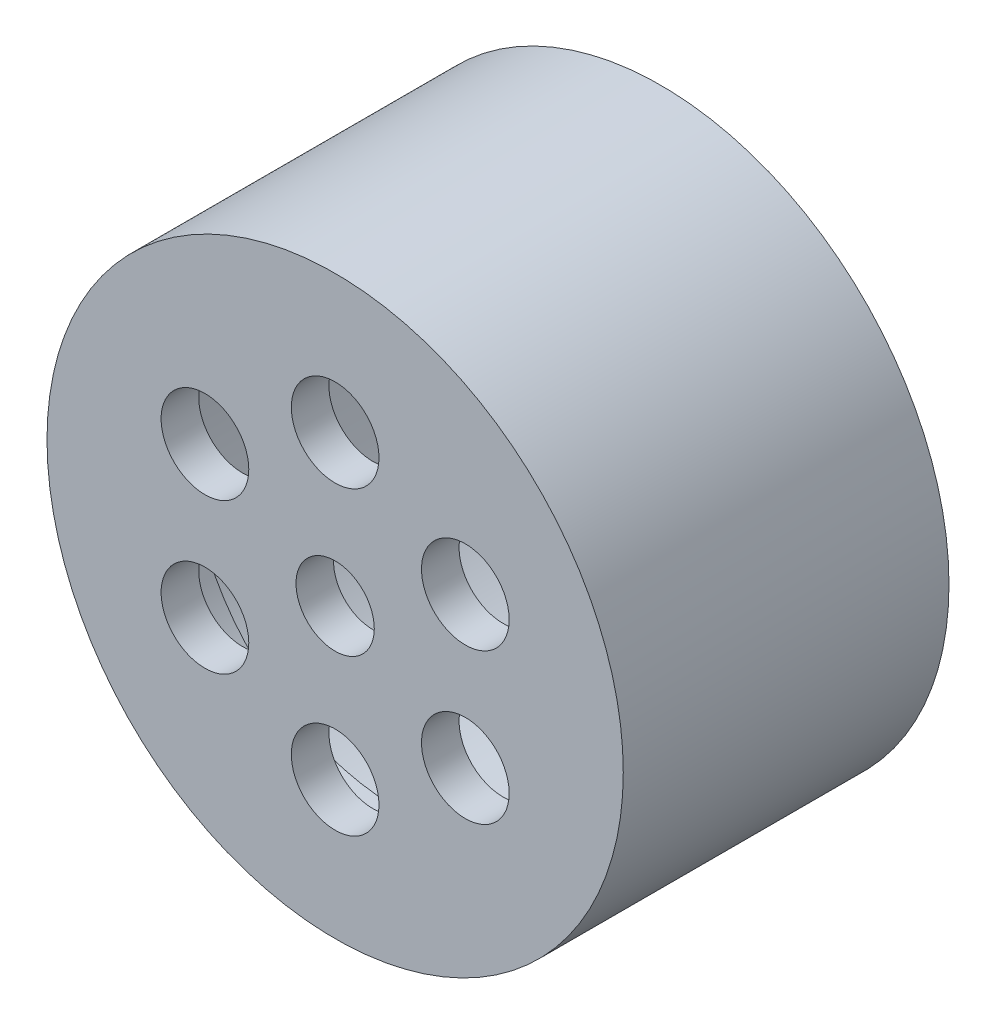
ISO-10303-21;
HEADER;
FILE_DESCRIPTION(('STEP AP214'),'2;1');
FILE_NAME('part.step','',(''),(''),'','','');
FILE_SCHEMA(('AUTOMOTIVE_DESIGN { 1 0 10303 214 1 1 1 1 }'));
ENDSEC;
DATA;
#1=APPLICATION_CONTEXT('core data for automotive mechanical design processes');
#2=APPLICATION_PROTOCOL_DEFINITION('international standard','automotive_design',2000,#1);
#3=PRODUCT_CONTEXT('',#1,'mechanical');
#4=PRODUCT('Part','Part','',(#3));
#5=PRODUCT_RELATED_PRODUCT_CATEGORY('part','',(#4));
#6=PRODUCT_DEFINITION_FORMATION('','',#4);
#7=PRODUCT_DEFINITION_CONTEXT('part definition',#1,'design');
#8=PRODUCT_DEFINITION('design','',#6,#7);
#9=PRODUCT_DEFINITION_SHAPE('','',#8);
#10=(LENGTH_UNIT() NAMED_UNIT(*) SI_UNIT(.MILLI.,.METRE.));
#11=(NAMED_UNIT(*) PLANE_ANGLE_UNIT() SI_UNIT($,.RADIAN.));
#12=(NAMED_UNIT(*) SI_UNIT($,.STERADIAN.) SOLID_ANGLE_UNIT());
#13=UNCERTAINTY_MEASURE_WITH_UNIT(LENGTH_MEASURE(1.E-05),#10,'distance_accuracy_value','');
#14=(GEOMETRIC_REPRESENTATION_CONTEXT(3) GLOBAL_UNCERTAINTY_ASSIGNED_CONTEXT((#13)) GLOBAL_UNIT_ASSIGNED_CONTEXT((#10,
#11,#12)) REPRESENTATION_CONTEXT('',''));
#15=CARTESIAN_POINT('',(0.,0.,0.));
#16=DIRECTION('',(0.,0.,1.));
#17=DIRECTION('',(1.,0.,0.));
#18=AXIS2_PLACEMENT_3D('',#15,#16,#17);
#19=CARTESIAN_POINT('',(0.,0.,23.));
#20=DIRECTION('',(0.,0.,1.));
#21=DIRECTION('',(1.,0.,0.));
#22=AXIS2_PLACEMENT_3D('',#19,#20,#21);
#23=PLANE('',#22);
#24=CARTESIAN_POINT('',(0.,0.,23.));
#25=DIRECTION('',(0.,0.,1.));
#26=DIRECTION('',(1.,0.,0.));
#27=AXIS2_PLACEMENT_3D('',#24,#25,#26);
#28=CIRCLE('',#27,3.125);
#29=CARTESIAN_POINT('',(3.125,0.,23.));
#30=VERTEX_POINT('',#29);
#31=EDGE_CURVE('E62',#30,#30,#28,.T.);
#32=ORIENTED_EDGE('',*,*,#31,.T.);
#33=EDGE_LOOP('',(#32));
#34=FACE_BOUND('',#33,.T.);
#35=CARTESIAN_POINT('',(0.,12.,23.));
#36=DIRECTION('',(0.,0.,1.));
#37=DIRECTION('',(1.,0.,0.));
#38=AXIS2_PLACEMENT_3D('',#35,#36,#37);
#39=CIRCLE('',#38,3.5);
#40=CARTESIAN_POINT('',(3.5,12.,23.));
#41=VERTEX_POINT('',#40);
#42=EDGE_CURVE('E70',#41,#41,#39,.T.);
#43=ORIENTED_EDGE('',*,*,#42,.T.);
#44=EDGE_LOOP('',(#43));
#45=FACE_BOUND('',#44,.T.);
#46=CARTESIAN_POINT('',(10.3923048454136,6.00000000000063,23.));
#47=DIRECTION('',(0.,0.,1.));
#48=DIRECTION('',(1.,0.,0.));
#49=AXIS2_PLACEMENT_3D('',#46,#47,#48);
#50=CIRCLE('',#49,3.5);
#51=CARTESIAN_POINT('',(13.8923048454136,6.00000000000063,23.));
#52=VERTEX_POINT('',#51);
#53=EDGE_CURVE('E78',#52,#52,#50,.T.);
#54=ORIENTED_EDGE('',*,*,#53,.T.);
#55=EDGE_LOOP('',(#54));
#56=FACE_BOUND('',#55,.T.);
#57=CARTESIAN_POINT('',(10.3923048454143,-5.99999999999937,23.));
#58=DIRECTION('',(0.,0.,1.));
#59=DIRECTION('',(1.,0.,0.));
#60=AXIS2_PLACEMENT_3D('',#57,#58,#59);
#61=CIRCLE('',#60,3.5);
#62=CARTESIAN_POINT('',(13.8923048454143,-5.99999999999937,23.));
#63=VERTEX_POINT('',#62);
#64=EDGE_CURVE('E86',#63,#63,#61,.T.);
#65=ORIENTED_EDGE('',*,*,#64,.T.);
#66=EDGE_LOOP('',(#65));
#67=FACE_BOUND('',#66,.T.);
#68=CARTESIAN_POINT('',(1.44264915887538E-12,-12.,23.));
#69=DIRECTION('',(0.,0.,1.));
#70=DIRECTION('',(1.,0.,0.));
#71=AXIS2_PLACEMENT_3D('',#68,#69,#70);
#72=CIRCLE('',#71,3.5);
#73=CARTESIAN_POINT('',(3.50000000000144,-12.,23.));
#74=VERTEX_POINT('',#73);
#75=EDGE_CURVE('E94',#74,#74,#72,.T.);
#76=ORIENTED_EDGE('',*,*,#75,.T.);
#77=EDGE_LOOP('',(#76));
#78=FACE_BOUND('',#77,.T.);
#79=CARTESIAN_POINT('',(-10.3923048454122,-6.00000000000063,23.));
#80=DIRECTION('',(0.,0.,1.));
#81=DIRECTION('',(1.,0.,0.));
#82=AXIS2_PLACEMENT_3D('',#79,#80,#81);
#83=CIRCLE('',#82,3.5);
#84=CARTESIAN_POINT('',(-6.89230484541218,-6.00000000000063,23.));
#85=VERTEX_POINT('',#84);
#86=EDGE_CURVE('E102',#85,#85,#83,.T.);
#87=ORIENTED_EDGE('',*,*,#86,.T.);
#88=EDGE_LOOP('',(#87));
#89=FACE_BOUND('',#88,.T.);
#90=CARTESIAN_POINT('',(-10.3923048454129,5.99999999999937,23.));
#91=DIRECTION('',(0.,0.,1.));
#92=DIRECTION('',(1.,0.,0.));
#93=AXIS2_PLACEMENT_3D('',#90,#91,#92);
#94=CIRCLE('',#93,3.5);
#95=CARTESIAN_POINT('',(-6.89230484541291,5.99999999999937,23.));
#96=VERTEX_POINT('',#95);
#97=EDGE_CURVE('E110',#96,#96,#94,.T.);
#98=ORIENTED_EDGE('',*,*,#97,.T.);
#99=EDGE_LOOP('',(#98));
#100=FACE_BOUND('',#99,.T.);
#101=CARTESIAN_POINT('',(0.,0.,23.));
#102=DIRECTION('',(0.,0.,-1.));
#103=DIRECTION('',(-1.,0.,0.));
#104=AXIS2_PLACEMENT_3D('',#101,#102,#103);
#105=CIRCLE('',#104,16.5);
#106=CARTESIAN_POINT('',(-16.5,0.,23.));
#107=VERTEX_POINT('',#106);
#108=EDGE_CURVE('E118',#107,#107,#105,.T.);
#109=ORIENTED_EDGE('',*,*,#108,.T.);
#110=EDGE_LOOP('',(#109));
#111=FACE_BOUND('',#110,.T.);
#112=ADVANCED_FACE('F37',(#34,#45,#56,#67,#78,#89,#100,#111),#23,.F.);
#113=CARTESIAN_POINT('',(0.,0.,0.));
#114=DIRECTION('',(0.,0.,1.));
#115=DIRECTION('',(1.,0.,0.));
#116=AXIS2_PLACEMENT_3D('',#113,#114,#115);
#117=PLANE('',#116);
#118=CARTESIAN_POINT('',(0.,0.,0.));
#119=DIRECTION('',(0.,0.,1.));
#120=DIRECTION('',(1.,0.,0.));
#121=AXIS2_PLACEMENT_3D('',#118,#119,#120);
#122=CIRCLE('',#121,23.);
#123=CARTESIAN_POINT('',(23.,0.,0.));
#124=VERTEX_POINT('',#123);
#125=EDGE_CURVE('E45',#124,#124,#122,.T.);
#126=ORIENTED_EDGE('',*,*,#125,.F.);
#127=EDGE_LOOP('',(#126));
#128=FACE_BOUND('',#127,.T.);
#129=CARTESIAN_POINT('',(0.,0.,0.));
#130=DIRECTION('',(0.,0.,1.));
#131=DIRECTION('',(1.,0.,0.));
#132=AXIS2_PLACEMENT_3D('',#129,#130,#131);
#133=CIRCLE('',#132,21.);
#134=CARTESIAN_POINT('',(21.,0.,0.));
#135=VERTEX_POINT('',#134);
#136=EDGE_CURVE('E50',#135,#135,#133,.T.);
#137=ORIENTED_EDGE('',*,*,#136,.T.);
#138=EDGE_LOOP('',(#137));
#139=FACE_BOUND('',#138,.T.);
#140=ADVANCED_FACE('F142',(#128,#139),#117,.F.);
#141=CARTESIAN_POINT('',(0.,0.,23.));
#142=DIRECTION('',(0.,0.,-1.));
#143=DIRECTION('',(-1.,0.,0.));
#144=AXIS2_PLACEMENT_3D('',#141,#142,#143);
#145=CYLINDRICAL_SURFACE('',#144,23.);
#146=ORIENTED_EDGE('',*,*,#125,.T.);
#147=EDGE_LOOP('',(#146));
#148=FACE_BOUND('',#147,.T.);
#149=CARTESIAN_POINT('',(0.,0.,26.));
#150=DIRECTION('',(0.,0.,1.));
#151=DIRECTION('',(1.,0.,0.));
#152=AXIS2_PLACEMENT_3D('',#149,#150,#151);
#153=CIRCLE('',#152,23.);
#154=CARTESIAN_POINT('',(23.,0.,26.));
#155=VERTEX_POINT('',#154);
#156=EDGE_CURVE('E55',#155,#155,#153,.T.);
#157=ORIENTED_EDGE('',*,*,#156,.F.);
#158=EDGE_LOOP('',(#157));
#159=FACE_BOUND('',#158,.T.);
#160=ADVANCED_FACE('F39',(#148,#159),#145,.T.);
#161=CARTESIAN_POINT('',(0.,0.,23.));
#162=DIRECTION('',(0.,0.,-1.));
#163=DIRECTION('',(-1.,0.,0.));
#164=AXIS2_PLACEMENT_3D('',#161,#162,#163);
#165=CYLINDRICAL_SURFACE('',#164,21.);
#166=CARTESIAN_POINT('',(0.,0.,21.));
#167=DIRECTION('',(0.,0.,-1.));
#168=DIRECTION('',(-1.,0.,0.));
#169=AXIS2_PLACEMENT_3D('',#166,#167,#168);
#170=CIRCLE('',#169,21.);
#171=CARTESIAN_POINT('',(-21.,0.,21.));
#172=VERTEX_POINT('',#171);
#173=EDGE_CURVE('E10',#172,#172,#170,.T.);
#174=ORIENTED_EDGE('',*,*,#173,.F.);
#175=EDGE_LOOP('',(#174));
#176=FACE_BOUND('',#175,.T.);
#177=ORIENTED_EDGE('',*,*,#136,.F.);
#178=EDGE_LOOP('',(#177));
#179=FACE_BOUND('',#178,.T.);
#180=ADVANCED_FACE('F154',(#176,#179),#165,.F.);
#181=CARTESIAN_POINT('',(0.,0.,26.));
#182=DIRECTION('',(0.,0.,1.));
#183=DIRECTION('',(1.,0.,0.));
#184=AXIS2_PLACEMENT_3D('',#181,#182,#183);
#185=PLANE('',#184);
#186=CARTESIAN_POINT('',(-10.3923048454122,-6.00000000000063,26.));
#187=DIRECTION('',(0.,0.,1.));
#188=DIRECTION('',(1.,0.,0.));
#189=AXIS2_PLACEMENT_3D('',#186,#187,#188);
#190=CIRCLE('',#189,3.5);
#191=CARTESIAN_POINT('',(-6.89230484541218,-6.00000000000063,26.));
#192=VERTEX_POINT('',#191);
#193=EDGE_CURVE('E98',#192,#192,#190,.T.);
#194=ORIENTED_EDGE('',*,*,#193,.F.);
#195=EDGE_LOOP('',(#194));
#196=FACE_BOUND('',#195,.T.);
#197=CARTESIAN_POINT('',(10.3923048454143,-5.99999999999937,26.));
#198=DIRECTION('',(0.,0.,1.));
#199=DIRECTION('',(1.,0.,0.));
#200=AXIS2_PLACEMENT_3D('',#197,#198,#199);
#201=CIRCLE('',#200,3.5);
#202=CARTESIAN_POINT('',(13.8923048454143,-5.99999999999937,26.));
#203=VERTEX_POINT('',#202);
#204=EDGE_CURVE('E82',#203,#203,#201,.T.);
#205=ORIENTED_EDGE('',*,*,#204,.F.);
#206=EDGE_LOOP('',(#205));
#207=FACE_BOUND('',#206,.T.);
#208=CARTESIAN_POINT('',(0.,12.,26.));
#209=DIRECTION('',(0.,0.,1.));
#210=DIRECTION('',(1.,0.,0.));
#211=AXIS2_PLACEMENT_3D('',#208,#209,#210);
#212=CIRCLE('',#211,3.5);
#213=CARTESIAN_POINT('',(3.5,12.,26.));
#214=VERTEX_POINT('',#213);
#215=EDGE_CURVE('E66',#214,#214,#212,.T.);
#216=ORIENTED_EDGE('',*,*,#215,.F.);
#217=EDGE_LOOP('',(#216));
#218=FACE_BOUND('',#217,.T.);
#219=ORIENTED_EDGE('',*,*,#156,.T.);
#220=EDGE_LOOP('',(#219));
#221=FACE_BOUND('',#220,.T.);
#222=CARTESIAN_POINT('',(0.,0.,26.));
#223=DIRECTION('',(0.,0.,1.));
#224=DIRECTION('',(1.,0.,0.));
#225=AXIS2_PLACEMENT_3D('',#222,#223,#224);
#226=CIRCLE('',#225,3.125);
#227=CARTESIAN_POINT('',(3.125,0.,26.));
#228=VERTEX_POINT('',#227);
#229=EDGE_CURVE('E61',#228,#228,#226,.T.);
#230=ORIENTED_EDGE('',*,*,#229,.F.);
#231=EDGE_LOOP('',(#230));
#232=FACE_BOUND('',#231,.T.);
#233=CARTESIAN_POINT('',(10.3923048454136,6.00000000000063,26.));
#234=DIRECTION('',(0.,0.,1.));
#235=DIRECTION('',(1.,0.,0.));
#236=AXIS2_PLACEMENT_3D('',#233,#234,#235);
#237=CIRCLE('',#236,3.5);
#238=CARTESIAN_POINT('',(13.8923048454136,6.00000000000063,26.));
#239=VERTEX_POINT('',#238);
#240=EDGE_CURVE('E74',#239,#239,#237,.T.);
#241=ORIENTED_EDGE('',*,*,#240,.F.);
#242=EDGE_LOOP('',(#241));
#243=FACE_BOUND('',#242,.T.);
#244=CARTESIAN_POINT('',(1.44264915887538E-12,-12.,26.));
#245=DIRECTION('',(0.,0.,1.));
#246=DIRECTION('',(1.,0.,0.));
#247=AXIS2_PLACEMENT_3D('',#244,#245,#246);
#248=CIRCLE('',#247,3.5);
#249=CARTESIAN_POINT('',(3.50000000000144,-12.,26.));
#250=VERTEX_POINT('',#249);
#251=EDGE_CURVE('E90',#250,#250,#248,.T.);
#252=ORIENTED_EDGE('',*,*,#251,.F.);
#253=EDGE_LOOP('',(#252));
#254=FACE_BOUND('',#253,.T.);
#255=CARTESIAN_POINT('',(-10.3923048454129,5.99999999999937,26.));
#256=DIRECTION('',(0.,0.,1.));
#257=DIRECTION('',(1.,0.,0.));
#258=AXIS2_PLACEMENT_3D('',#255,#256,#257);
#259=CIRCLE('',#258,3.5);
#260=CARTESIAN_POINT('',(-6.89230484541291,5.99999999999937,26.));
#261=VERTEX_POINT('',#260);
#262=EDGE_CURVE('E106',#261,#261,#259,.T.);
#263=ORIENTED_EDGE('',*,*,#262,.F.);
#264=EDGE_LOOP('',(#263));
#265=FACE_BOUND('',#264,.T.);
#266=ADVANCED_FACE('F152',(#196,#207,#218,#221,#232,#243,#254,#265),#185,.T.);
#267=CARTESIAN_POINT('',(0.,0.,26.));
#268=DIRECTION('',(0.,0.,-1.));
#269=DIRECTION('',(-1.,0.,0.));
#270=AXIS2_PLACEMENT_3D('',#267,#268,#269);
#271=CYLINDRICAL_SURFACE('',#270,3.125);
#272=ORIENTED_EDGE('',*,*,#229,.T.);
#273=EDGE_LOOP('',(#272));
#274=FACE_BOUND('',#273,.T.);
#275=ORIENTED_EDGE('',*,*,#31,.F.);
#276=EDGE_LOOP('',(#275));
#277=FACE_BOUND('',#276,.T.);
#278=ADVANCED_FACE('F161',(#274,#277),#271,.F.);
#279=CARTESIAN_POINT('',(0.,12.,26.));
#280=DIRECTION('',(0.,0.,-1.));
#281=DIRECTION('',(-1.,0.,0.));
#282=AXIS2_PLACEMENT_3D('',#279,#280,#281);
#283=CYLINDRICAL_SURFACE('',#282,3.5);
#284=ORIENTED_EDGE('',*,*,#215,.T.);
#285=EDGE_LOOP('',(#284));
#286=FACE_BOUND('',#285,.T.);
#287=ORIENTED_EDGE('',*,*,#42,.F.);
#288=EDGE_LOOP('',(#287));
#289=FACE_BOUND('',#288,.T.);
#290=ADVANCED_FACE('F207',(#286,#289),#283,.F.);
#291=CARTESIAN_POINT('',(10.3923048454136,6.00000000000063,26.));
#292=DIRECTION('',(0.,0.,-1.));
#293=DIRECTION('',(-1.,0.,0.));
#294=AXIS2_PLACEMENT_3D('',#291,#292,#293);
#295=CYLINDRICAL_SURFACE('',#294,3.5);
#296=ORIENTED_EDGE('',*,*,#240,.T.);
#297=EDGE_LOOP('',(#296));
#298=FACE_BOUND('',#297,.T.);
#299=ORIENTED_EDGE('',*,*,#53,.F.);
#300=EDGE_LOOP('',(#299));
#301=FACE_BOUND('',#300,.T.);
#302=ADVANCED_FACE('F203',(#298,#301),#295,.F.);
#303=CARTESIAN_POINT('',(10.3923048454143,-5.99999999999937,26.));
#304=DIRECTION('',(0.,0.,-1.));
#305=DIRECTION('',(-1.,0.,0.));
#306=AXIS2_PLACEMENT_3D('',#303,#304,#305);
#307=CYLINDRICAL_SURFACE('',#306,3.5);
#308=ORIENTED_EDGE('',*,*,#204,.T.);
#309=EDGE_LOOP('',(#308));
#310=FACE_BOUND('',#309,.T.);
#311=ORIENTED_EDGE('',*,*,#64,.F.);
#312=EDGE_LOOP('',(#311));
#313=FACE_BOUND('',#312,.T.);
#314=ADVANCED_FACE('F188',(#310,#313),#307,.F.);
#315=CARTESIAN_POINT('',(1.44264915887538E-12,-12.,26.));
#316=DIRECTION('',(0.,0.,-1.));
#317=DIRECTION('',(-1.,0.,0.));
#318=AXIS2_PLACEMENT_3D('',#315,#316,#317);
#319=CYLINDRICAL_SURFACE('',#318,3.5);
#320=ORIENTED_EDGE('',*,*,#251,.T.);
#321=EDGE_LOOP('',(#320));
#322=FACE_BOUND('',#321,.T.);
#323=ORIENTED_EDGE('',*,*,#75,.F.);
#324=EDGE_LOOP('',(#323));
#325=FACE_BOUND('',#324,.T.);
#326=ADVANCED_FACE('F185',(#322,#325),#319,.F.);
#327=CARTESIAN_POINT('',(-10.3923048454122,-6.00000000000063,26.));
#328=DIRECTION('',(0.,0.,-1.));
#329=DIRECTION('',(-1.,0.,0.));
#330=AXIS2_PLACEMENT_3D('',#327,#328,#329);
#331=CYLINDRICAL_SURFACE('',#330,3.5);
#332=ORIENTED_EDGE('',*,*,#193,.T.);
#333=EDGE_LOOP('',(#332));
#334=FACE_BOUND('',#333,.T.);
#335=ORIENTED_EDGE('',*,*,#86,.F.);
#336=EDGE_LOOP('',(#335));
#337=FACE_BOUND('',#336,.T.);
#338=ADVANCED_FACE('F138',(#334,#337),#331,.F.);
#339=CARTESIAN_POINT('',(-10.3923048454129,5.99999999999937,26.));
#340=DIRECTION('',(0.,0.,-1.));
#341=DIRECTION('',(-1.,0.,0.));
#342=AXIS2_PLACEMENT_3D('',#339,#340,#341);
#343=CYLINDRICAL_SURFACE('',#342,3.5);
#344=ORIENTED_EDGE('',*,*,#262,.T.);
#345=EDGE_LOOP('',(#344));
#346=FACE_BOUND('',#345,.T.);
#347=ORIENTED_EDGE('',*,*,#97,.F.);
#348=EDGE_LOOP('',(#347));
#349=FACE_BOUND('',#348,.T.);
#350=ADVANCED_FACE('F131',(#346,#349),#343,.F.);
#351=CARTESIAN_POINT('',(0.,0.,21.));
#352=DIRECTION('',(0.,0.,-1.));
#353=DIRECTION('',(-1.,0.,0.));
#354=AXIS2_PLACEMENT_3D('',#351,#352,#353);
#355=PLANE('',#354);
#356=ORIENTED_EDGE('',*,*,#173,.T.);
#357=EDGE_LOOP('',(#356));
#358=FACE_BOUND('',#357,.T.);
#359=CARTESIAN_POINT('',(0.,0.,21.));
#360=DIRECTION('',(0.,0.,-1.));
#361=DIRECTION('',(-1.,0.,0.));
#362=AXIS2_PLACEMENT_3D('',#359,#360,#361);
#363=CIRCLE('',#362,16.5);
#364=CARTESIAN_POINT('',(-16.5,0.,21.));
#365=VERTEX_POINT('',#364);
#366=EDGE_CURVE('E114',#365,#365,#363,.T.);
#367=ORIENTED_EDGE('',*,*,#366,.F.);
#368=EDGE_LOOP('',(#367));
#369=FACE_BOUND('',#368,.T.);
#370=ADVANCED_FACE('F129',(#358,#369),#355,.T.);
#371=CARTESIAN_POINT('',(0.,0.,21.));
#372=DIRECTION('',(0.,0.,1.));
#373=DIRECTION('',(1.,0.,0.));
#374=AXIS2_PLACEMENT_3D('',#371,#372,#373);
#375=CYLINDRICAL_SURFACE('',#374,16.5);
#376=ORIENTED_EDGE('',*,*,#366,.T.);
#377=EDGE_LOOP('',(#376));
#378=FACE_BOUND('',#377,.T.);
#379=ORIENTED_EDGE('',*,*,#108,.F.);
#380=EDGE_LOOP('',(#379));
#381=FACE_BOUND('',#380,.T.);
#382=ADVANCED_FACE('F126',(#378,#381),#375,.F.);
#383=CLOSED_SHELL('',(#112,#140,#160,#180,#266,#278,#290,#302,#314,#326,#338,#350,#370,#382));
#384=MANIFOLD_SOLID_BREP('B2',#383);
#385=ADVANCED_BREP_SHAPE_REPRESENTATION('',(#18,#384),#14);
#386=SHAPE_DEFINITION_REPRESENTATION(#9,#385);
ENDSEC;
END-ISO-10303-21;
